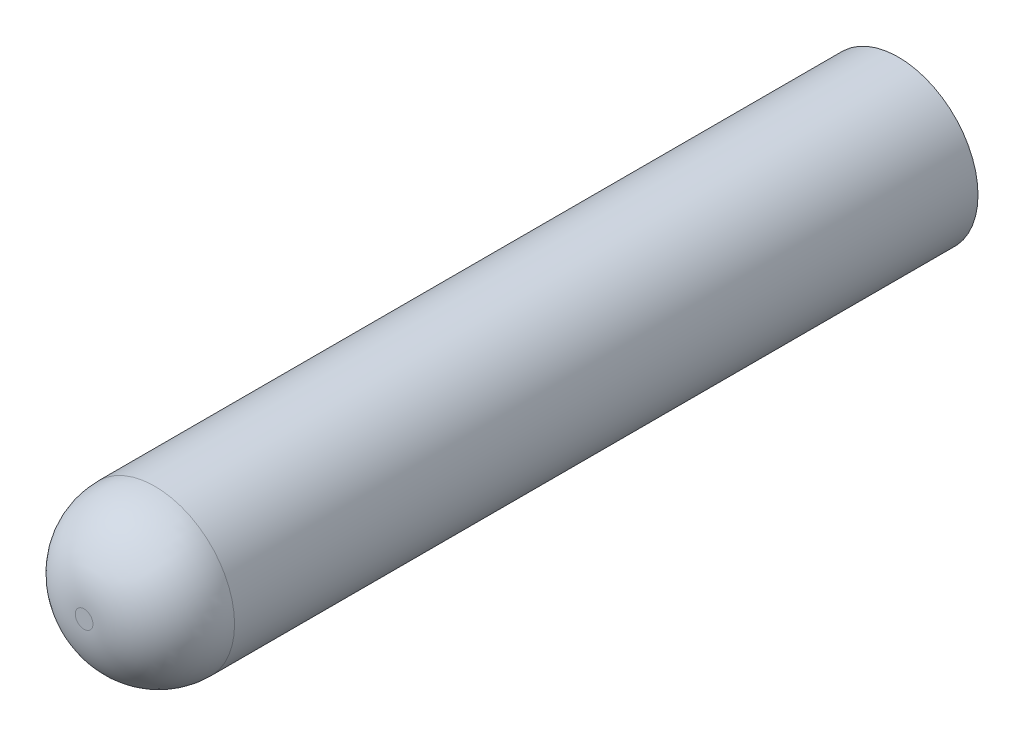
ISO-10303-21;
HEADER;
FILE_DESCRIPTION(('STEP AP214'),'2;1');
FILE_NAME('part.step','',(''),(''),'','','');
FILE_SCHEMA(('AUTOMOTIVE_DESIGN { 1 0 10303 214 1 1 1 1 }'));
ENDSEC;
DATA;
#1=APPLICATION_CONTEXT('core data for automotive mechanical design processes');
#2=APPLICATION_PROTOCOL_DEFINITION('international standard','automotive_design',2000,#1);
#3=PRODUCT_CONTEXT('',#1,'mechanical');
#4=PRODUCT('Part','Part','',(#3));
#5=PRODUCT_RELATED_PRODUCT_CATEGORY('part','',(#4));
#6=PRODUCT_DEFINITION_FORMATION('','',#4);
#7=PRODUCT_DEFINITION_CONTEXT('part definition',#1,'design');
#8=PRODUCT_DEFINITION('design','',#6,#7);
#9=PRODUCT_DEFINITION_SHAPE('','',#8);
#10=(LENGTH_UNIT() NAMED_UNIT(*) SI_UNIT(.MILLI.,.METRE.));
#11=(NAMED_UNIT(*) PLANE_ANGLE_UNIT() SI_UNIT($,.RADIAN.));
#12=(NAMED_UNIT(*) SI_UNIT($,.STERADIAN.) SOLID_ANGLE_UNIT());
#13=UNCERTAINTY_MEASURE_WITH_UNIT(LENGTH_MEASURE(1.E-05),#10,'distance_accuracy_value','');
#14=(GEOMETRIC_REPRESENTATION_CONTEXT(3) GLOBAL_UNCERTAINTY_ASSIGNED_CONTEXT((#13)) GLOBAL_UNIT_ASSIGNED_CONTEXT((#10,
#11,#12)) REPRESENTATION_CONTEXT('',''));
#15=CARTESIAN_POINT('',(0.,0.,0.));
#16=DIRECTION('',(0.,0.,1.));
#17=DIRECTION('',(1.,0.,0.));
#18=AXIS2_PLACEMENT_3D('',#15,#16,#17);
#19=CARTESIAN_POINT('',(0.,0.,23.));
#20=DIRECTION('',(0.,0.,-1.));
#21=DIRECTION('',(-1.,0.,0.));
#22=AXIS2_PLACEMENT_3D('',#19,#20,#21);
#23=CYLINDRICAL_SURFACE('',#22,2.25);
#24=CARTESIAN_POINT('',(0.,0.,21.));
#25=DIRECTION('',(0.,0.,1.));
#26=DIRECTION('',(1.,0.,0.));
#27=AXIS2_PLACEMENT_3D('',#24,#25,#26);
#28=CIRCLE('',#27,2.25);
#29=CARTESIAN_POINT('',(2.25,0.,21.));
#30=VERTEX_POINT('',#29);
#31=EDGE_CURVE('E11',#30,#30,#28,.F.);
#32=ORIENTED_EDGE('',*,*,#31,.T.);
#33=EDGE_LOOP('',(#32));
#34=FACE_BOUND('',#33,.T.);
#35=CARTESIAN_POINT('',(0.,0.,0.));
#36=DIRECTION('',(0.,0.,1.));
#37=DIRECTION('',(1.,0.,0.));
#38=AXIS2_PLACEMENT_3D('',#35,#36,#37);
#39=CIRCLE('',#38,2.25);
#40=CARTESIAN_POINT('',(2.25,0.,0.));
#41=VERTEX_POINT('',#40);
#42=EDGE_CURVE('E128',#41,#41,#39,.T.);
#43=ORIENTED_EDGE('',*,*,#42,.T.);
#44=EDGE_LOOP('',(#43));
#45=FACE_BOUND('',#44,.T.);
#46=ADVANCED_FACE('F41',(#34,#45),#23,.T.);
#47=CARTESIAN_POINT('',(0.,0.,23.));
#48=DIRECTION('',(0.,0.,1.));
#49=DIRECTION('',(1.,0.,0.));
#50=AXIS2_PLACEMENT_3D('',#47,#48,#49);
#51=PLANE('',#50);
#52=CARTESIAN_POINT('',(0.,0.,23.));
#53=DIRECTION('',(0.,0.,1.));
#54=DIRECTION('',(1.,0.,0.));
#55=AXIS2_PLACEMENT_3D('',#52,#53,#54);
#56=CIRCLE('',#55,0.25);
#57=CARTESIAN_POINT('',(0.25,0.,23.));
#58=VERTEX_POINT('',#57);
#59=EDGE_CURVE('E50',#58,#58,#56,.T.);
#60=ORIENTED_EDGE('',*,*,#59,.T.);
#61=EDGE_LOOP('',(#60));
#62=FACE_BOUND('',#61,.T.);
#63=ADVANCED_FACE('F139',(#62),#51,.T.);
#64=CARTESIAN_POINT('',(0.,0.,0.));
#65=DIRECTION('',(0.,0.,1.));
#66=DIRECTION('',(1.,0.,0.));
#67=AXIS2_PLACEMENT_3D('',#64,#65,#66);
#68=PLANE('',#67);
#69=DIRECTION('',(-1.,0.,0.));
#70=VECTOR('',#69,1.);
#71=CARTESIAN_POINT('',(0.,-1.175,0.));
#72=LINE('',#71,#70);
#73=CARTESIAN_POINT('',(1.175,-1.175,0.));
#74=VERTEX_POINT('',#73);
#75=CARTESIAN_POINT('',(-1.175,-1.175,0.));
#76=VERTEX_POINT('',#75);
#77=EDGE_CURVE('E92',#74,#76,#72,.T.);
#78=ORIENTED_EDGE('',*,*,#77,.F.);
#79=DIRECTION('',(0.,-1.,0.));
#80=VECTOR('',#79,1.);
#81=CARTESIAN_POINT('',(1.175,0.,0.));
#82=LINE('',#81,#80);
#83=CARTESIAN_POINT('',(1.175,1.175,0.));
#84=VERTEX_POINT('',#83);
#85=EDGE_CURVE('E57',#84,#74,#82,.T.);
#86=ORIENTED_EDGE('',*,*,#85,.F.);
#87=DIRECTION('',(1.,0.,0.));
#88=VECTOR('',#87,1.);
#89=CARTESIAN_POINT('',(0.,1.175,0.));
#90=LINE('',#89,#88);
#91=CARTESIAN_POINT('',(-1.175,1.175,0.));
#92=VERTEX_POINT('',#91);
#93=EDGE_CURVE('E112',#92,#84,#90,.T.);
#94=ORIENTED_EDGE('',*,*,#93,.F.);
#95=DIRECTION('',(0.,1.,0.));
#96=VECTOR('',#95,1.);
#97=CARTESIAN_POINT('',(-1.175,0.,0.));
#98=LINE('',#97,#96);
#99=EDGE_CURVE('E121',#76,#92,#98,.T.);
#100=ORIENTED_EDGE('',*,*,#99,.F.);
#101=EDGE_LOOP('',(#78,#86,#94,#100));
#102=FACE_BOUND('',#101,.T.);
#103=ORIENTED_EDGE('',*,*,#42,.F.);
#104=EDGE_LOOP('',(#103));
#105=FACE_BOUND('',#104,.T.);
#106=ADVANCED_FACE('F153',(#102,#105),#68,.F.);
#107=CARTESIAN_POINT('',(1.175,0.,4.5));
#108=DIRECTION('',(1.,0.,0.));
#109=DIRECTION('',(0.,0.,-1.));
#110=AXIS2_PLACEMENT_3D('',#107,#108,#109);
#111=PLANE('',#110);
#112=ORIENTED_EDGE('',*,*,#85,.T.);
#113=DIRECTION('',(0.,0.,-1.));
#114=VECTOR('',#113,1.);
#115=CARTESIAN_POINT('',(1.175,-1.175,4.5));
#116=LINE('',#115,#114);
#117=CARTESIAN_POINT('',(1.175,-1.175,4.5));
#118=VERTEX_POINT('',#117);
#119=EDGE_CURVE('E80',#118,#74,#116,.T.);
#120=ORIENTED_EDGE('',*,*,#119,.F.);
#121=DIRECTION('',(0.,-1.,0.));
#122=VECTOR('',#121,1.);
#123=CARTESIAN_POINT('',(1.175,0.,4.5));
#124=LINE('',#123,#122);
#125=CARTESIAN_POINT('',(1.175,1.175,4.5));
#126=VERTEX_POINT('',#125);
#127=EDGE_CURVE('E108',#126,#118,#124,.T.);
#128=ORIENTED_EDGE('',*,*,#127,.F.);
#129=DIRECTION('',(0.,0.,-1.));
#130=VECTOR('',#129,1.);
#131=CARTESIAN_POINT('',(1.175,1.175,4.5));
#132=LINE('',#131,#130);
#133=EDGE_CURVE('E65',#126,#84,#132,.T.);
#134=ORIENTED_EDGE('',*,*,#133,.T.);
#135=EDGE_LOOP('',(#112,#120,#128,#134));
#136=FACE_BOUND('',#135,.T.);
#137=ADVANCED_FACE('F158',(#136),#111,.F.);
#138=CARTESIAN_POINT('',(0.,1.175,4.5));
#139=DIRECTION('',(0.,1.,0.));
#140=DIRECTION('',(-1.,0.,0.));
#141=AXIS2_PLACEMENT_3D('',#138,#139,#140);
#142=PLANE('',#141);
#143=ORIENTED_EDGE('',*,*,#93,.T.);
#144=ORIENTED_EDGE('',*,*,#133,.F.);
#145=DIRECTION('',(1.,0.,0.));
#146=VECTOR('',#145,1.);
#147=CARTESIAN_POINT('',(0.,1.175,4.5));
#148=LINE('',#147,#146);
#149=CARTESIAN_POINT('',(-1.175,1.175,4.5));
#150=VERTEX_POINT('',#149);
#151=EDGE_CURVE('E105',#150,#126,#148,.T.);
#152=ORIENTED_EDGE('',*,*,#151,.F.);
#153=DIRECTION('',(0.,0.,-1.));
#154=VECTOR('',#153,1.);
#155=CARTESIAN_POINT('',(-1.175,1.175,4.5));
#156=LINE('',#155,#154);
#157=EDGE_CURVE('E97',#150,#92,#156,.T.);
#158=ORIENTED_EDGE('',*,*,#157,.T.);
#159=EDGE_LOOP('',(#143,#144,#152,#158));
#160=FACE_BOUND('',#159,.T.);
#161=ADVANCED_FACE('F163',(#160),#142,.F.);
#162=CARTESIAN_POINT('',(-1.175,0.,4.5));
#163=DIRECTION('',(-1.,0.,0.));
#164=DIRECTION('',(0.,0.,1.));
#165=AXIS2_PLACEMENT_3D('',#162,#163,#164);
#166=PLANE('',#165);
#167=ORIENTED_EDGE('',*,*,#99,.T.);
#168=ORIENTED_EDGE('',*,*,#157,.F.);
#169=DIRECTION('',(0.,1.,0.));
#170=VECTOR('',#169,1.);
#171=CARTESIAN_POINT('',(-1.175,0.,4.5));
#172=LINE('',#171,#170);
#173=CARTESIAN_POINT('',(-1.175,-1.175,4.5));
#174=VERTEX_POINT('',#173);
#175=EDGE_CURVE('E100',#174,#150,#172,.T.);
#176=ORIENTED_EDGE('',*,*,#175,.F.);
#177=DIRECTION('',(0.,0.,-1.));
#178=VECTOR('',#177,1.);
#179=CARTESIAN_POINT('',(-1.175,-1.175,4.5));
#180=LINE('',#179,#178);
#181=EDGE_CURVE('E85',#174,#76,#180,.T.);
#182=ORIENTED_EDGE('',*,*,#181,.T.);
#183=EDGE_LOOP('',(#167,#168,#176,#182));
#184=FACE_BOUND('',#183,.T.);
#185=ADVANCED_FACE('F101',(#184),#166,.F.);
#186=CARTESIAN_POINT('',(0.,-1.175,4.5));
#187=DIRECTION('',(0.,-1.,0.));
#188=DIRECTION('',(0.,0.,-1.));
#189=AXIS2_PLACEMENT_3D('',#186,#187,#188);
#190=PLANE('',#189);
#191=ORIENTED_EDGE('',*,*,#77,.T.);
#192=ORIENTED_EDGE('',*,*,#181,.F.);
#193=DIRECTION('',(-1.,0.,0.));
#194=VECTOR('',#193,1.);
#195=CARTESIAN_POINT('',(0.,-1.175,4.5));
#196=LINE('',#195,#194);
#197=EDGE_CURVE('E89',#118,#174,#196,.T.);
#198=ORIENTED_EDGE('',*,*,#197,.F.);
#199=ORIENTED_EDGE('',*,*,#119,.T.);
#200=EDGE_LOOP('',(#191,#192,#198,#199));
#201=FACE_BOUND('',#200,.T.);
#202=ADVANCED_FACE('F87',(#201),#190,.F.);
#203=CARTESIAN_POINT('',(0.,0.,4.5));
#204=DIRECTION('',(0.,0.,-1.));
#205=DIRECTION('',(-1.,0.,0.));
#206=AXIS2_PLACEMENT_3D('',#203,#204,#205);
#207=PLANE('',#206);
#208=ORIENTED_EDGE('',*,*,#127,.T.);
#209=ORIENTED_EDGE('',*,*,#197,.T.);
#210=ORIENTED_EDGE('',*,*,#175,.T.);
#211=ORIENTED_EDGE('',*,*,#151,.T.);
#212=EDGE_LOOP('',(#208,#209,#210,#211));
#213=FACE_BOUND('',#212,.T.);
#214=ADVANCED_FACE('F107',(#213),#207,.T.);
#215=CARTESIAN_POINT('',(0.,0.,21.));
#216=DIRECTION('',(0.,0.,1.));
#217=DIRECTION('',(1.,0.,0.));
#218=AXIS2_PLACEMENT_3D('',#215,#216,#217);
#219=DEGENERATE_TOROIDAL_SURFACE('',#218,0.25,2.,.T.);
#220=ORIENTED_EDGE('',*,*,#31,.F.);
#221=EDGE_LOOP('',(#220));
#222=FACE_BOUND('',#221,.T.);
#223=ORIENTED_EDGE('',*,*,#59,.F.);
#224=EDGE_LOOP('',(#223));
#225=FACE_BOUND('',#224,.T.);
#226=ADVANCED_FACE('F43',(#222,#225),#219,.T.);
#227=CLOSED_SHELL('',(#46,#63,#106,#137,#161,#185,#202,#214,#226));
#228=MANIFOLD_SOLID_BREP('B2',#227);
#229=ADVANCED_BREP_SHAPE_REPRESENTATION('',(#18,#228),#14);
#230=SHAPE_DEFINITION_REPRESENTATION(#9,#229);
ENDSEC;
END-ISO-10303-21;
